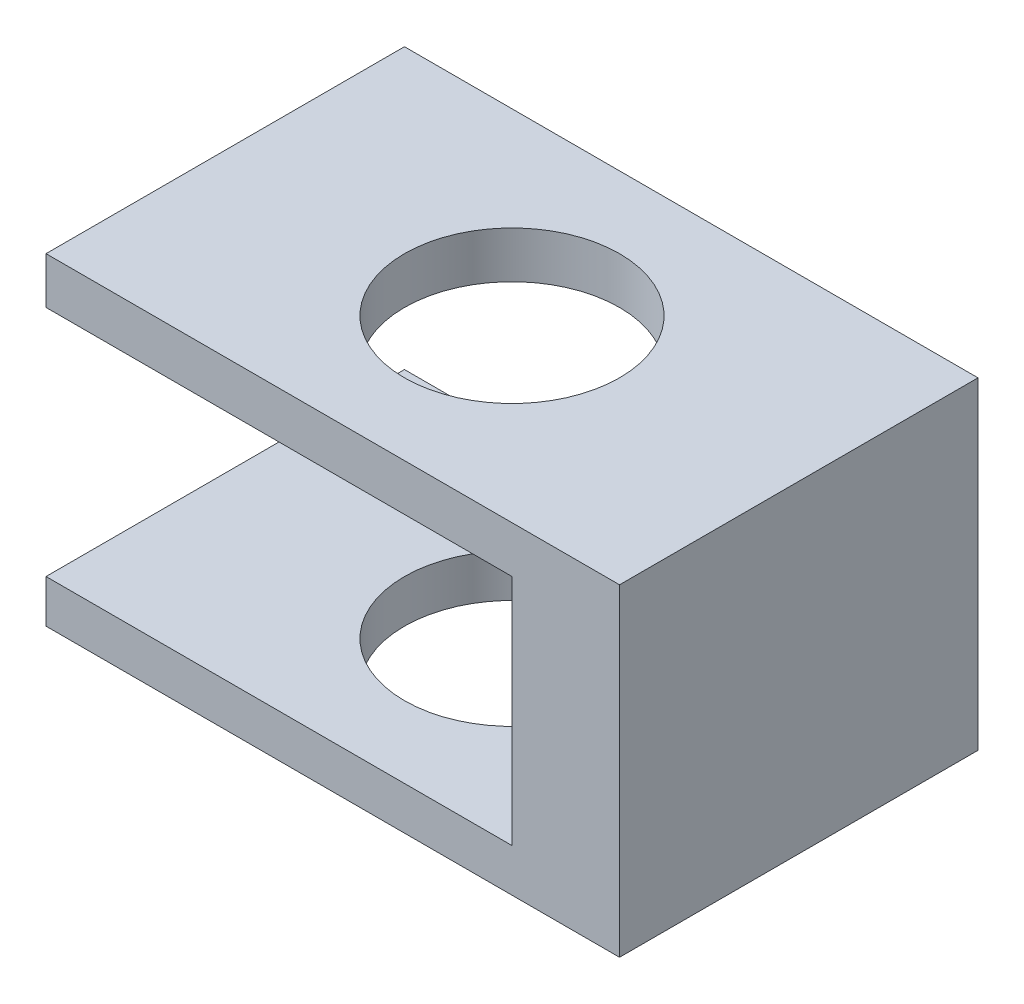
ISO-10303-21;
HEADER;
FILE_DESCRIPTION(('STEP AP214'),'2;1');
FILE_NAME('part.step','',(''),(''),'','','');
FILE_SCHEMA(('AUTOMOTIVE_DESIGN { 1 0 10303 214 1 1 1 1 }'));
ENDSEC;
DATA;
#1=APPLICATION_CONTEXT('core data for automotive mechanical design processes');
#2=APPLICATION_PROTOCOL_DEFINITION('international standard','automotive_design',2000,#1);
#3=PRODUCT_CONTEXT('',#1,'mechanical');
#4=PRODUCT('Part','Part','',(#3));
#5=PRODUCT_RELATED_PRODUCT_CATEGORY('part','',(#4));
#6=PRODUCT_DEFINITION_FORMATION('','',#4);
#7=PRODUCT_DEFINITION_CONTEXT('part definition',#1,'design');
#8=PRODUCT_DEFINITION('design','',#6,#7);
#9=PRODUCT_DEFINITION_SHAPE('','',#8);
#10=(LENGTH_UNIT() NAMED_UNIT(*) SI_UNIT(.MILLI.,.METRE.));
#11=(NAMED_UNIT(*) PLANE_ANGLE_UNIT() SI_UNIT($,.RADIAN.));
#12=(NAMED_UNIT(*) SI_UNIT($,.STERADIAN.) SOLID_ANGLE_UNIT());
#13=UNCERTAINTY_MEASURE_WITH_UNIT(LENGTH_MEASURE(1.E-05),#10,'distance_accuracy_value','');
#14=(GEOMETRIC_REPRESENTATION_CONTEXT(3) GLOBAL_UNCERTAINTY_ASSIGNED_CONTEXT((#13)) GLOBAL_UNIT_ASSIGNED_CONTEXT((#10,
#11,#12)) REPRESENTATION_CONTEXT('',''));
#15=CARTESIAN_POINT('',(0.,0.,0.));
#16=DIRECTION('',(0.,0.,1.));
#17=DIRECTION('',(1.,0.,0.));
#18=AXIS2_PLACEMENT_3D('',#15,#16,#17);
#19=CARTESIAN_POINT('',(-0.800000000000002,0.449999999999996,1.));
#20=DIRECTION('',(1.,0.,0.));
#21=DIRECTION('',(0.,1.,0.));
#22=AXIS2_PLACEMENT_3D('',#19,#20,#21);
#23=PLANE('',#22);
#24=DIRECTION('',(0.,-1.,0.));
#25=VECTOR('',#24,1.);
#26=CARTESIAN_POINT('',(-0.800000000000002,0.449999999999996,0.));
#27=LINE('',#26,#25);
#28=CARTESIAN_POINT('',(-0.800000000000002,0.449999999999996,0.));
#29=VERTEX_POINT('',#28);
#30=CARTESIAN_POINT('',(-0.800000000000002,0.319999999999997,0.));
#31=VERTEX_POINT('',#30);
#32=EDGE_CURVE('E127',#29,#31,#27,.T.);
#33=ORIENTED_EDGE('',*,*,#32,.T.);
#34=DIRECTION('',(0.,0.,1.));
#35=VECTOR('',#34,1.);
#36=CARTESIAN_POINT('',(-0.800000000000002,0.319999999999997,0.));
#37=LINE('',#36,#35);
#38=CARTESIAN_POINT('',(-0.800000000000002,0.319999999999997,1.));
#39=VERTEX_POINT('',#38);
#40=EDGE_CURVE('E122',#31,#39,#37,.T.);
#41=ORIENTED_EDGE('',*,*,#40,.T.);
#42=DIRECTION('',(0.,-1.,0.));
#43=VECTOR('',#42,1.);
#44=CARTESIAN_POINT('',(-0.800000000000002,0.449999999999996,1.));
#45=LINE('',#44,#43);
#46=CARTESIAN_POINT('',(-0.800000000000002,0.449999999999996,1.));
#47=VERTEX_POINT('',#46);
#48=EDGE_CURVE('E201',#47,#39,#45,.T.);
#49=ORIENTED_EDGE('',*,*,#48,.F.);
#50=DIRECTION('',(0.,0.,-1.));
#51=VECTOR('',#50,1.);
#52=CARTESIAN_POINT('',(-0.800000000000002,0.449999999999996,1.));
#53=LINE('',#52,#51);
#54=EDGE_CURVE('E141',#47,#29,#53,.T.);
#55=ORIENTED_EDGE('',*,*,#54,.T.);
#56=EDGE_LOOP('',(#33,#41,#49,#55));
#57=FACE_BOUND('',#56,.T.);
#58=ADVANCED_FACE('F33',(#57),#23,.F.);
#59=CARTESIAN_POINT('',(0.,-0.550000000000004,0.5));
#60=DIRECTION('',(0.,1.,0.));
#61=DIRECTION('',(0.,0.,1.));
#62=AXIS2_PLACEMENT_3D('',#59,#60,#61);
#63=CYLINDRICAL_SURFACE('',#62,0.3);
#64=CARTESIAN_POINT('',(0.,0.319999999999997,0.5));
#65=DIRECTION('',(0.,1.,0.));
#66=DIRECTION('',(0.,0.,1.));
#67=AXIS2_PLACEMENT_3D('',#64,#65,#66);
#68=CIRCLE('',#67,0.3);
#69=CARTESIAN_POINT('',(0.,0.319999999999997,0.8));
#70=VERTEX_POINT('',#69);
#71=EDGE_CURVE('E11',#70,#70,#68,.F.);
#72=ORIENTED_EDGE('',*,*,#71,.T.);
#73=EDGE_LOOP('',(#72));
#74=FACE_BOUND('',#73,.T.);
#75=CARTESIAN_POINT('',(0.,0.449999999999996,0.5));
#76=DIRECTION('',(0.,1.,0.));
#77=DIRECTION('',(0.,0.,1.));
#78=AXIS2_PLACEMENT_3D('',#75,#76,#77);
#79=CIRCLE('',#78,0.3);
#80=CARTESIAN_POINT('',(0.,0.449999999999996,0.8));
#81=VERTEX_POINT('',#80);
#82=EDGE_CURVE('E148',#81,#81,#79,.T.);
#83=ORIENTED_EDGE('',*,*,#82,.T.);
#84=EDGE_LOOP('',(#83));
#85=FACE_BOUND('',#84,.T.);
#86=ADVANCED_FACE('F169',(#74,#85),#63,.F.);
#87=CARTESIAN_POINT('',(0.799999999999998,0.449999999999996,1.));
#88=DIRECTION('',(-1.,0.,0.));
#89=DIRECTION('',(0.,-1.,0.));
#90=AXIS2_PLACEMENT_3D('',#87,#88,#89);
#91=PLANE('',#90);
#92=DIRECTION('',(0.,1.,0.));
#93=VECTOR('',#92,1.);
#94=CARTESIAN_POINT('',(0.799999999999998,0.449999999999996,0.));
#95=LINE('',#94,#93);
#96=CARTESIAN_POINT('',(0.799999999999998,-0.450000000000003,0.));
#97=VERTEX_POINT('',#96);
#98=CARTESIAN_POINT('',(0.799999999999998,0.449999999999996,0.));
#99=VERTEX_POINT('',#98);
#100=EDGE_CURVE('E131',#97,#99,#95,.T.);
#101=ORIENTED_EDGE('',*,*,#100,.T.);
#102=DIRECTION('',(0.,0.,-1.));
#103=VECTOR('',#102,1.);
#104=CARTESIAN_POINT('',(0.799999999999998,0.449999999999996,1.));
#105=LINE('',#104,#103);
#106=CARTESIAN_POINT('',(0.799999999999998,0.449999999999996,1.));
#107=VERTEX_POINT('',#106);
#108=EDGE_CURVE('E144',#107,#99,#105,.T.);
#109=ORIENTED_EDGE('',*,*,#108,.F.);
#110=DIRECTION('',(0.,1.,0.));
#111=VECTOR('',#110,1.);
#112=CARTESIAN_POINT('',(0.799999999999998,0.449999999999996,1.));
#113=LINE('',#112,#111);
#114=CARTESIAN_POINT('',(0.799999999999998,-0.450000000000003,1.));
#115=VERTEX_POINT('',#114);
#116=EDGE_CURVE('E136',#115,#107,#113,.T.);
#117=ORIENTED_EDGE('',*,*,#116,.F.);
#118=DIRECTION('',(0.,0.,-1.));
#119=VECTOR('',#118,1.);
#120=CARTESIAN_POINT('',(0.799999999999998,-0.450000000000003,1.));
#121=LINE('',#120,#119);
#122=EDGE_CURVE('E137',#115,#97,#121,.T.);
#123=ORIENTED_EDGE('',*,*,#122,.T.);
#124=EDGE_LOOP('',(#101,#109,#117,#123));
#125=FACE_BOUND('',#124,.T.);
#126=ADVANCED_FACE('F35',(#125),#91,.F.);
#127=CARTESIAN_POINT('',(-0.800000000000002,0.449999999999996,1.));
#128=DIRECTION('',(0.,-1.,0.));
#129=DIRECTION('',(0.,0.,-1.));
#130=AXIS2_PLACEMENT_3D('',#127,#128,#129);
#131=PLANE('',#130);
#132=ORIENTED_EDGE('',*,*,#82,.F.);
#133=EDGE_LOOP('',(#132));
#134=FACE_BOUND('',#133,.T.);
#135=DIRECTION('',(-1.,0.,0.));
#136=VECTOR('',#135,1.);
#137=CARTESIAN_POINT('',(-0.800000000000002,0.449999999999996,0.));
#138=LINE('',#137,#136);
#139=EDGE_CURVE('E128',#99,#29,#138,.T.);
#140=ORIENTED_EDGE('',*,*,#139,.T.);
#141=ORIENTED_EDGE('',*,*,#54,.F.);
#142=DIRECTION('',(-1.,0.,0.));
#143=VECTOR('',#142,1.);
#144=CARTESIAN_POINT('',(-0.800000000000002,0.449999999999996,1.));
#145=LINE('',#144,#143);
#146=EDGE_CURVE('E82',#107,#47,#145,.T.);
#147=ORIENTED_EDGE('',*,*,#146,.F.);
#148=ORIENTED_EDGE('',*,*,#108,.T.);
#149=EDGE_LOOP('',(#140,#141,#147,#148));
#150=FACE_BOUND('',#149,.T.);
#151=ADVANCED_FACE('F180',(#134,#150),#131,.F.);
#152=CARTESIAN_POINT('',(-0.800000000000002,-0.330000000000003,1.));
#153=VERTEX_POINT('',#152);
#154=CARTESIAN_POINT('',(-0.800000000000002,-0.450000000000003,1.));
#155=VERTEX_POINT('',#154);
#156=EDGE_CURVE('E121',#153,#155,#45,.T.);
#157=ORIENTED_EDGE('',*,*,#156,.F.);
#158=DIRECTION('',(0.,0.,1.));
#159=VECTOR('',#158,1.);
#160=CARTESIAN_POINT('',(-0.800000000000002,-0.330000000000003,0.));
#161=LINE('',#160,#159);
#162=CARTESIAN_POINT('',(-0.800000000000002,-0.330000000000003,0.));
#163=VERTEX_POINT('',#162);
#164=EDGE_CURVE('E112',#163,#153,#161,.T.);
#165=ORIENTED_EDGE('',*,*,#164,.F.);
#166=CARTESIAN_POINT('',(-0.800000000000002,-0.450000000000003,0.));
#167=VERTEX_POINT('',#166);
#168=EDGE_CURVE('E68',#163,#167,#27,.T.);
#169=ORIENTED_EDGE('',*,*,#168,.T.);
#170=DIRECTION('',(0.,0.,-1.));
#171=VECTOR('',#170,1.);
#172=CARTESIAN_POINT('',(-0.800000000000002,-0.450000000000003,1.));
#173=LINE('',#172,#171);
#174=EDGE_CURVE('E139',#155,#167,#173,.T.);
#175=ORIENTED_EDGE('',*,*,#174,.F.);
#176=EDGE_LOOP('',(#157,#165,#169,#175));
#177=FACE_BOUND('',#176,.T.);
#178=ADVANCED_FACE('F120',(#177),#23,.F.);
#179=CARTESIAN_POINT('',(-0.800000000000002,-0.450000000000003,1.));
#180=DIRECTION('',(0.,1.,0.));
#181=DIRECTION('',(0.,0.,1.));
#182=AXIS2_PLACEMENT_3D('',#179,#180,#181);
#183=PLANE('',#182);
#184=CARTESIAN_POINT('',(0.,-0.450000000000003,0.5));
#185=DIRECTION('',(0.,1.,0.));
#186=DIRECTION('',(0.,0.,1.));
#187=AXIS2_PLACEMENT_3D('',#184,#185,#186);
#188=CIRCLE('',#187,0.3);
#189=CARTESIAN_POINT('',(0.,-0.450000000000003,0.8));
#190=VERTEX_POINT('',#189);
#191=EDGE_CURVE('E146',#190,#190,#188,.T.);
#192=ORIENTED_EDGE('',*,*,#191,.T.);
#193=EDGE_LOOP('',(#192));
#194=FACE_BOUND('',#193,.T.);
#195=DIRECTION('',(1.,0.,0.));
#196=VECTOR('',#195,1.);
#197=CARTESIAN_POINT('',(-0.800000000000002,-0.450000000000003,0.));
#198=LINE('',#197,#196);
#199=EDGE_CURVE('E74',#167,#97,#198,.T.);
#200=ORIENTED_EDGE('',*,*,#199,.T.);
#201=ORIENTED_EDGE('',*,*,#122,.F.);
#202=DIRECTION('',(1.,0.,0.));
#203=VECTOR('',#202,1.);
#204=CARTESIAN_POINT('',(-0.800000000000002,-0.450000000000003,1.));
#205=LINE('',#204,#203);
#206=EDGE_CURVE('E50',#155,#115,#205,.T.);
#207=ORIENTED_EDGE('',*,*,#206,.F.);
#208=ORIENTED_EDGE('',*,*,#174,.T.);
#209=EDGE_LOOP('',(#200,#201,#207,#208));
#210=FACE_BOUND('',#209,.T.);
#211=ADVANCED_FACE('F179',(#194,#210),#183,.F.);
#212=CARTESIAN_POINT('',(0.,0.,1.));
#213=DIRECTION('',(0.,0.,1.));
#214=DIRECTION('',(1.,0.,0.));
#215=AXIS2_PLACEMENT_3D('',#212,#213,#214);
#216=PLANE('',#215);
#217=ORIENTED_EDGE('',*,*,#48,.T.);
#218=DIRECTION('',(-1.,0.,0.));
#219=VECTOR('',#218,1.);
#220=CARTESIAN_POINT('',(-0.500000000000002,0.319999999999997,1.));
#221=LINE('',#220,#219);
#222=CARTESIAN_POINT('',(0.499999999999998,0.319999999999997,1.));
#223=VERTEX_POINT('',#222);
#224=EDGE_CURVE('E214',#223,#39,#221,.T.);
#225=ORIENTED_EDGE('',*,*,#224,.F.);
#226=DIRECTION('',(0.,1.,0.));
#227=VECTOR('',#226,1.);
#228=CARTESIAN_POINT('',(0.499999999999998,0.319999999999997,1.));
#229=LINE('',#228,#227);
#230=CARTESIAN_POINT('',(0.499999999999998,-0.330000000000003,1.));
#231=VERTEX_POINT('',#230);
#232=EDGE_CURVE('E211',#231,#223,#229,.T.);
#233=ORIENTED_EDGE('',*,*,#232,.F.);
#234=DIRECTION('',(1.,0.,0.));
#235=VECTOR('',#234,1.);
#236=CARTESIAN_POINT('',(-0.500000000000002,-0.330000000000003,1.));
#237=LINE('',#236,#235);
#238=EDGE_CURVE('E208',#153,#231,#237,.T.);
#239=ORIENTED_EDGE('',*,*,#238,.F.);
#240=ORIENTED_EDGE('',*,*,#156,.T.);
#241=ORIENTED_EDGE('',*,*,#206,.T.);
#242=ORIENTED_EDGE('',*,*,#116,.T.);
#243=ORIENTED_EDGE('',*,*,#146,.T.);
#244=EDGE_LOOP('',(#217,#225,#233,#239,#240,#241,#242,#243));
#245=FACE_BOUND('',#244,.T.);
#246=ADVANCED_FACE('F185',(#245),#216,.T.);
#247=CARTESIAN_POINT('',(0.,0.,0.));
#248=DIRECTION('',(0.,0.,1.));
#249=DIRECTION('',(1.,0.,0.));
#250=AXIS2_PLACEMENT_3D('',#247,#248,#249);
#251=PLANE('',#250);
#252=DIRECTION('',(0.,1.,0.));
#253=VECTOR('',#252,1.);
#254=CARTESIAN_POINT('',(0.499999999999998,0.319999999999997,0.));
#255=LINE('',#254,#253);
#256=CARTESIAN_POINT('',(0.499999999999998,-0.330000000000003,0.));
#257=VERTEX_POINT('',#256);
#258=CARTESIAN_POINT('',(0.499999999999998,0.319999999999997,0.));
#259=VERTEX_POINT('',#258);
#260=EDGE_CURVE('E118',#257,#259,#255,.T.);
#261=ORIENTED_EDGE('',*,*,#260,.T.);
#262=DIRECTION('',(-1.,0.,0.));
#263=VECTOR('',#262,1.);
#264=CARTESIAN_POINT('',(-0.800000000000002,0.319999999999997,0.));
#265=LINE('',#264,#263);
#266=EDGE_CURVE('E123',#259,#31,#265,.T.);
#267=ORIENTED_EDGE('',*,*,#266,.T.);
#268=ORIENTED_EDGE('',*,*,#32,.F.);
#269=ORIENTED_EDGE('',*,*,#139,.F.);
#270=ORIENTED_EDGE('',*,*,#100,.F.);
#271=ORIENTED_EDGE('',*,*,#199,.F.);
#272=ORIENTED_EDGE('',*,*,#168,.F.);
#273=DIRECTION('',(1.,0.,0.));
#274=VECTOR('',#273,1.);
#275=CARTESIAN_POINT('',(-0.800000000000002,-0.330000000000003,0.));
#276=LINE('',#275,#274);
#277=EDGE_CURVE('E109',#163,#257,#276,.T.);
#278=ORIENTED_EDGE('',*,*,#277,.T.);
#279=EDGE_LOOP('',(#261,#267,#268,#269,#270,#271,#272,#278));
#280=FACE_BOUND('',#279,.T.);
#281=ADVANCED_FACE('F125',(#280),#251,.F.);
#282=CARTESIAN_POINT('',(0.,-0.330000000000003,0.5));
#283=DIRECTION('',(0.,-1.,0.));
#284=DIRECTION('',(0.,0.,-1.));
#285=AXIS2_PLACEMENT_3D('',#282,#283,#284);
#286=CIRCLE('',#285,0.3);
#287=CARTESIAN_POINT('',(0.,-0.330000000000003,0.2));
#288=VERTEX_POINT('',#287);
#289=EDGE_CURVE('E42',#288,#288,#286,.F.);
#290=ORIENTED_EDGE('',*,*,#289,.T.);
#291=EDGE_LOOP('',(#290));
#292=FACE_BOUND('',#291,.T.);
#293=ORIENTED_EDGE('',*,*,#191,.F.);
#294=EDGE_LOOP('',(#293));
#295=FACE_BOUND('',#294,.T.);
#296=ADVANCED_FACE('F152',(#292,#295),#63,.F.);
#297=CARTESIAN_POINT('',(-0.500000000000002,0.319999999999997,0.2));
#298=DIRECTION('',(0.,1.,0.));
#299=DIRECTION('',(0.,0.,1.));
#300=AXIS2_PLACEMENT_3D('',#297,#298,#299);
#301=PLANE('',#300);
#302=ORIENTED_EDGE('',*,*,#71,.F.);
#303=EDGE_LOOP('',(#302));
#304=FACE_BOUND('',#303,.T.);
#305=ORIENTED_EDGE('',*,*,#266,.F.);
#306=DIRECTION('',(0.,0.,1.));
#307=VECTOR('',#306,1.);
#308=CARTESIAN_POINT('',(0.499999999999998,0.319999999999997,0.2));
#309=LINE('',#308,#307);
#310=EDGE_CURVE('E216',#259,#223,#309,.T.);
#311=ORIENTED_EDGE('',*,*,#310,.T.);
#312=ORIENTED_EDGE('',*,*,#224,.T.);
#313=ORIENTED_EDGE('',*,*,#40,.F.);
#314=EDGE_LOOP('',(#305,#311,#312,#313));
#315=FACE_BOUND('',#314,.T.);
#316=ADVANCED_FACE('F157',(#304,#315),#301,.F.);
#317=CARTESIAN_POINT('',(-0.500000000000002,-0.330000000000003,0.2));
#318=DIRECTION('',(0.,-1.,0.));
#319=DIRECTION('',(0.,0.,-1.));
#320=AXIS2_PLACEMENT_3D('',#317,#318,#319);
#321=PLANE('',#320);
#322=ORIENTED_EDGE('',*,*,#289,.F.);
#323=EDGE_LOOP('',(#322));
#324=FACE_BOUND('',#323,.T.);
#325=DIRECTION('',(0.,0.,1.));
#326=VECTOR('',#325,1.);
#327=CARTESIAN_POINT('',(0.499999999999998,-0.330000000000003,0.2));
#328=LINE('',#327,#326);
#329=EDGE_CURVE('E114',#257,#231,#328,.T.);
#330=ORIENTED_EDGE('',*,*,#329,.F.);
#331=ORIENTED_EDGE('',*,*,#277,.F.);
#332=ORIENTED_EDGE('',*,*,#164,.T.);
#333=ORIENTED_EDGE('',*,*,#238,.T.);
#334=EDGE_LOOP('',(#330,#331,#332,#333));
#335=FACE_BOUND('',#334,.T.);
#336=ADVANCED_FACE('F110',(#324,#335),#321,.F.);
#337=CARTESIAN_POINT('',(0.499999999999998,0.319999999999997,0.2));
#338=DIRECTION('',(1.,0.,0.));
#339=DIRECTION('',(0.,0.,-1.));
#340=AXIS2_PLACEMENT_3D('',#337,#338,#339);
#341=PLANE('',#340);
#342=ORIENTED_EDGE('',*,*,#232,.T.);
#343=ORIENTED_EDGE('',*,*,#310,.F.);
#344=ORIENTED_EDGE('',*,*,#260,.F.);
#345=ORIENTED_EDGE('',*,*,#329,.T.);
#346=EDGE_LOOP('',(#342,#343,#344,#345));
#347=FACE_BOUND('',#346,.T.);
#348=ADVANCED_FACE('F156',(#347),#341,.F.);
#349=CLOSED_SHELL('',(#58,#86,#126,#151,#178,#211,#246,#281,#296,#316,#336,#348));
#350=MANIFOLD_SOLID_BREP('B2',#349);
#351=ADVANCED_BREP_SHAPE_REPRESENTATION('',(#18,#350),#14);
#352=SHAPE_DEFINITION_REPRESENTATION(#9,#351);
ENDSEC;
END-ISO-10303-21;
